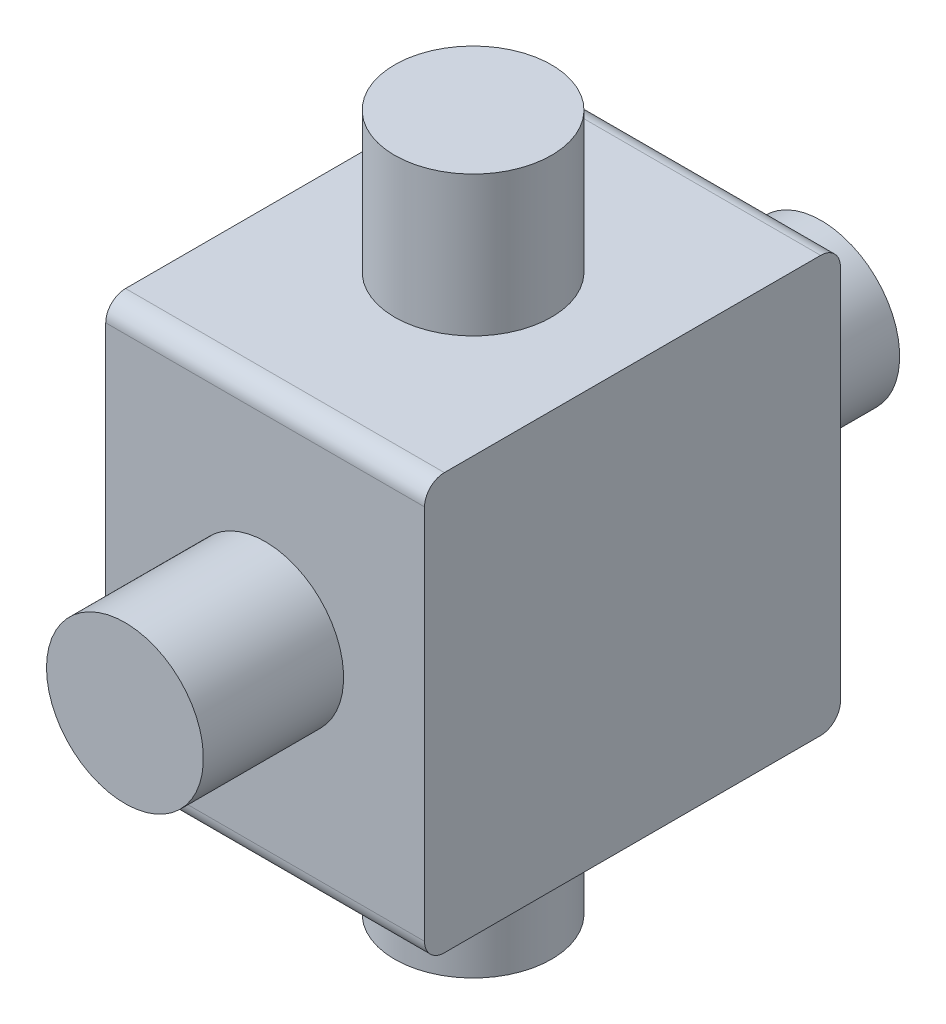
ISO-10303-21;
HEADER;
FILE_DESCRIPTION(('STEP AP214'),'2;1');
FILE_NAME('part.step','',(''),(''),'','','');
FILE_SCHEMA(('AUTOMOTIVE_DESIGN { 1 0 10303 214 1 1 1 1 }'));
ENDSEC;
DATA;
#1=APPLICATION_CONTEXT('core data for automotive mechanical design processes');
#2=APPLICATION_PROTOCOL_DEFINITION('international standard','automotive_design',2000,#1);
#3=PRODUCT_CONTEXT('',#1,'mechanical');
#4=PRODUCT('Part','Part','',(#3));
#5=PRODUCT_RELATED_PRODUCT_CATEGORY('part','',(#4));
#6=PRODUCT_DEFINITION_FORMATION('','',#4);
#7=PRODUCT_DEFINITION_CONTEXT('part definition',#1,'design');
#8=PRODUCT_DEFINITION('design','',#6,#7);
#9=PRODUCT_DEFINITION_SHAPE('','',#8);
#10=(LENGTH_UNIT() NAMED_UNIT(*) SI_UNIT(.MILLI.,.METRE.));
#11=(NAMED_UNIT(*) PLANE_ANGLE_UNIT() SI_UNIT($,.RADIAN.));
#12=(NAMED_UNIT(*) SI_UNIT($,.STERADIAN.) SOLID_ANGLE_UNIT());
#13=UNCERTAINTY_MEASURE_WITH_UNIT(LENGTH_MEASURE(1.E-05),#10,'distance_accuracy_value','');
#14=(GEOMETRIC_REPRESENTATION_CONTEXT(3) GLOBAL_UNCERTAINTY_ASSIGNED_CONTEXT((#13)) GLOBAL_UNIT_ASSIGNED_CONTEXT((#10,
#11,#12)) REPRESENTATION_CONTEXT('',''));
#15=CARTESIAN_POINT('',(0.,0.,0.));
#16=DIRECTION('',(0.,0.,1.));
#17=DIRECTION('',(1.,0.,0.));
#18=AXIS2_PLACEMENT_3D('',#15,#16,#17);
#19=CARTESIAN_POINT('',(-5.06,6.6,-6.6));
#20=DIRECTION('',(0.,1.,0.));
#21=DIRECTION('',(0.,0.,1.));
#22=AXIS2_PLACEMENT_3D('',#19,#20,#21);
#23=PLANE('',#22);
#24=CARTESIAN_POINT('',(0.,6.6,0.));
#25=DIRECTION('',(0.,1.,0.));
#26=DIRECTION('',(0.,0.,1.));
#27=AXIS2_PLACEMENT_3D('',#24,#25,#26);
#28=CIRCLE('',#27,2.49);
#29=CARTESIAN_POINT('',(0.,6.6,2.49));
#30=VERTEX_POINT('',#29);
#31=EDGE_CURVE('E130',#30,#30,#28,.T.);
#32=ORIENTED_EDGE('',*,*,#31,.F.);
#33=EDGE_LOOP('',(#32));
#34=FACE_BOUND('',#33,.T.);
#35=DIRECTION('',(0.,0.,1.));
#36=VECTOR('',#35,1.);
#37=CARTESIAN_POINT('',(-5.06,6.6,-6.6));
#38=LINE('',#37,#36);
#39=CARTESIAN_POINT('',(-5.06,6.6,-5.9714285714));
#40=VERTEX_POINT('',#39);
#41=CARTESIAN_POINT('',(-5.06,6.6,5.9714285714));
#42=VERTEX_POINT('',#41);
#43=EDGE_CURVE('E157',#40,#42,#38,.T.);
#44=ORIENTED_EDGE('',*,*,#43,.T.);
#45=DIRECTION('',(1.,0.,0.));
#46=VECTOR('',#45,1.);
#47=CARTESIAN_POINT('',(-5.06,6.6,5.9714285714));
#48=LINE('',#47,#46);
#49=CARTESIAN_POINT('',(5.06,6.6,5.9714285714));
#50=VERTEX_POINT('',#49);
#51=EDGE_CURVE('E11',#42,#50,#48,.T.);
#52=ORIENTED_EDGE('',*,*,#51,.T.);
#53=DIRECTION('',(0.,0.,1.));
#54=VECTOR('',#53,1.);
#55=CARTESIAN_POINT('',(5.06,6.6,-6.6));
#56=LINE('',#55,#54);
#57=CARTESIAN_POINT('',(5.06,6.6,-5.9714285714));
#58=VERTEX_POINT('',#57);
#59=EDGE_CURVE('E106',#58,#50,#56,.T.);
#60=ORIENTED_EDGE('',*,*,#59,.F.);
#61=DIRECTION('',(1.,0.,0.));
#62=VECTOR('',#61,1.);
#63=CARTESIAN_POINT('',(-5.06,6.6,-5.9714285714));
#64=LINE('',#63,#62);
#65=EDGE_CURVE('E42',#58,#40,#64,.F.);
#66=ORIENTED_EDGE('',*,*,#65,.T.);
#67=EDGE_LOOP('',(#44,#52,#60,#66));
#68=FACE_BOUND('',#67,.T.);
#69=ADVANCED_FACE('F34',(#34,#68),#23,.T.);
#70=CARTESIAN_POINT('',(-5.06,-6.6,-6.6));
#71=DIRECTION('',(0.,0.,-1.));
#72=DIRECTION('',(-1.,0.,0.));
#73=AXIS2_PLACEMENT_3D('',#70,#71,#72);
#74=PLANE('',#73);
#75=CARTESIAN_POINT('',(0.,0.,-6.6));
#76=DIRECTION('',(0.,0.,-1.));
#77=DIRECTION('',(-1.,0.,0.));
#78=AXIS2_PLACEMENT_3D('',#75,#76,#77);
#79=CIRCLE('',#78,2.49);
#80=CARTESIAN_POINT('',(-2.49,0.,-6.6));
#81=VERTEX_POINT('',#80);
#82=EDGE_CURVE('E126',#81,#81,#79,.T.);
#83=ORIENTED_EDGE('',*,*,#82,.F.);
#84=EDGE_LOOP('',(#83));
#85=FACE_BOUND('',#84,.T.);
#86=DIRECTION('',(0.,1.,0.));
#87=VECTOR('',#86,1.);
#88=CARTESIAN_POINT('',(5.06,-6.6,-6.6));
#89=LINE('',#88,#87);
#90=CARTESIAN_POINT('',(5.06,-5.9714285714,-6.6));
#91=VERTEX_POINT('',#90);
#92=CARTESIAN_POINT('',(5.06,5.9714285714,-6.6));
#93=VERTEX_POINT('',#92);
#94=EDGE_CURVE('E133',#91,#93,#89,.T.);
#95=ORIENTED_EDGE('',*,*,#94,.F.);
#96=DIRECTION('',(1.,0.,0.));
#97=VECTOR('',#96,1.);
#98=CARTESIAN_POINT('',(-5.06,-5.9714285714,-6.6));
#99=LINE('',#98,#97);
#100=CARTESIAN_POINT('',(-5.06,-5.9714285714,-6.6));
#101=VERTEX_POINT('',#100);
#102=EDGE_CURVE('E56',#91,#101,#99,.F.);
#103=ORIENTED_EDGE('',*,*,#102,.T.);
#104=DIRECTION('',(0.,1.,0.));
#105=VECTOR('',#104,1.);
#106=CARTESIAN_POINT('',(-5.06,-6.6,-6.6));
#107=LINE('',#106,#105);
#108=CARTESIAN_POINT('',(-5.06,5.9714285714,-6.6));
#109=VERTEX_POINT('',#108);
#110=EDGE_CURVE('E166',#101,#109,#107,.T.);
#111=ORIENTED_EDGE('',*,*,#110,.T.);
#112=DIRECTION('',(1.,0.,0.));
#113=VECTOR('',#112,1.);
#114=CARTESIAN_POINT('',(-5.06,5.9714285714,-6.6));
#115=LINE('',#114,#113);
#116=EDGE_CURVE('E151',#109,#93,#115,.T.);
#117=ORIENTED_EDGE('',*,*,#116,.T.);
#118=EDGE_LOOP('',(#95,#103,#111,#117));
#119=FACE_BOUND('',#118,.T.);
#120=ADVANCED_FACE('F165',(#85,#119),#74,.T.);
#121=CARTESIAN_POINT('',(-5.06,-6.6,6.6));
#122=DIRECTION('',(0.,-1.,0.));
#123=DIRECTION('',(0.,0.,-1.));
#124=AXIS2_PLACEMENT_3D('',#121,#122,#123);
#125=PLANE('',#124);
#126=CARTESIAN_POINT('',(0.,-6.6,0.));
#127=DIRECTION('',(0.,1.,0.));
#128=DIRECTION('',(0.,0.,1.));
#129=AXIS2_PLACEMENT_3D('',#126,#127,#128);
#130=CIRCLE('',#129,2.49);
#131=CARTESIAN_POINT('',(0.,-6.6,2.49));
#132=VERTEX_POINT('',#131);
#133=EDGE_CURVE('E187',#132,#132,#130,.T.);
#134=ORIENTED_EDGE('',*,*,#133,.T.);
#135=EDGE_LOOP('',(#134));
#136=FACE_BOUND('',#135,.T.);
#137=DIRECTION('',(0.,0.,-1.));
#138=VECTOR('',#137,1.);
#139=CARTESIAN_POINT('',(5.06,-6.6,6.6));
#140=LINE('',#139,#138);
#141=CARTESIAN_POINT('',(5.06,-6.6,5.9714285714));
#142=VERTEX_POINT('',#141);
#143=CARTESIAN_POINT('',(5.06,-6.6,-5.9714285714));
#144=VERTEX_POINT('',#143);
#145=EDGE_CURVE('E121',#142,#144,#140,.T.);
#146=ORIENTED_EDGE('',*,*,#145,.F.);
#147=DIRECTION('',(1.,0.,0.));
#148=VECTOR('',#147,1.);
#149=CARTESIAN_POINT('',(-5.06,-6.6,5.9714285714));
#150=LINE('',#149,#148);
#151=CARTESIAN_POINT('',(-5.06,-6.6,5.9714285714));
#152=VERTEX_POINT('',#151);
#153=EDGE_CURVE('E143',#142,#152,#150,.F.);
#154=ORIENTED_EDGE('',*,*,#153,.T.);
#155=DIRECTION('',(0.,0.,-1.));
#156=VECTOR('',#155,1.);
#157=CARTESIAN_POINT('',(-5.06,-6.6,6.6));
#158=LINE('',#157,#156);
#159=CARTESIAN_POINT('',(-5.06,-6.6,-5.9714285714));
#160=VERTEX_POINT('',#159);
#161=EDGE_CURVE('E173',#152,#160,#158,.T.);
#162=ORIENTED_EDGE('',*,*,#161,.T.);
#163=DIRECTION('',(1.,0.,0.));
#164=VECTOR('',#163,1.);
#165=CARTESIAN_POINT('',(-5.06,-6.6,-5.9714285714));
#166=LINE('',#165,#164);
#167=EDGE_CURVE('E140',#160,#144,#166,.T.);
#168=ORIENTED_EDGE('',*,*,#167,.T.);
#169=EDGE_LOOP('',(#146,#154,#162,#168));
#170=FACE_BOUND('',#169,.T.);
#171=ADVANCED_FACE('F220',(#136,#170),#125,.T.);
#172=CARTESIAN_POINT('',(-5.06,6.6,6.6));
#173=DIRECTION('',(0.,0.,1.));
#174=DIRECTION('',(1.,0.,0.));
#175=AXIS2_PLACEMENT_3D('',#172,#173,#174);
#176=PLANE('',#175);
#177=CARTESIAN_POINT('',(0.,0.,6.6));
#178=DIRECTION('',(0.,0.,-1.));
#179=DIRECTION('',(-1.,0.,0.));
#180=AXIS2_PLACEMENT_3D('',#177,#178,#179);
#181=CIRCLE('',#180,2.49);
#182=CARTESIAN_POINT('',(-2.49,0.,6.6));
#183=VERTEX_POINT('',#182);
#184=EDGE_CURVE('E193',#183,#183,#181,.T.);
#185=ORIENTED_EDGE('',*,*,#184,.T.);
#186=EDGE_LOOP('',(#185));
#187=FACE_BOUND('',#186,.T.);
#188=DIRECTION('',(0.,-1.,0.));
#189=VECTOR('',#188,1.);
#190=CARTESIAN_POINT('',(-5.06,6.6,6.6));
#191=LINE('',#190,#189);
#192=CARTESIAN_POINT('',(-5.06,5.9714285714,6.6));
#193=VERTEX_POINT('',#192);
#194=CARTESIAN_POINT('',(-5.06,-5.9714285714,6.6));
#195=VERTEX_POINT('',#194);
#196=EDGE_CURVE('E161',#193,#195,#191,.T.);
#197=ORIENTED_EDGE('',*,*,#196,.T.);
#198=DIRECTION('',(1.,0.,0.));
#199=VECTOR('',#198,1.);
#200=CARTESIAN_POINT('',(-5.06,-5.9714285714,6.6));
#201=LINE('',#200,#199);
#202=CARTESIAN_POINT('',(5.06,-5.9714285714,6.6));
#203=VERTEX_POINT('',#202);
#204=EDGE_CURVE('E120',#195,#203,#201,.T.);
#205=ORIENTED_EDGE('',*,*,#204,.T.);
#206=DIRECTION('',(0.,-1.,0.));
#207=VECTOR('',#206,1.);
#208=CARTESIAN_POINT('',(5.06,6.6,6.6));
#209=LINE('',#208,#207);
#210=CARTESIAN_POINT('',(5.06,5.9714285714,6.6));
#211=VERTEX_POINT('',#210);
#212=EDGE_CURVE('E104',#211,#203,#209,.T.);
#213=ORIENTED_EDGE('',*,*,#212,.F.);
#214=DIRECTION('',(1.,0.,0.));
#215=VECTOR('',#214,1.);
#216=CARTESIAN_POINT('',(-5.06,5.9714285714,6.6));
#217=LINE('',#216,#215);
#218=EDGE_CURVE('E117',#211,#193,#217,.F.);
#219=ORIENTED_EDGE('',*,*,#218,.T.);
#220=EDGE_LOOP('',(#197,#205,#213,#219));
#221=FACE_BOUND('',#220,.T.);
#222=ADVANCED_FACE('F116',(#187,#221),#176,.T.);
#223=CARTESIAN_POINT('',(-5.06,0.,0.));
#224=DIRECTION('',(1.,0.,0.));
#225=DIRECTION('',(0.,0.,-1.));
#226=AXIS2_PLACEMENT_3D('',#223,#224,#225);
#227=PLANE('',#226);
#228=ORIENTED_EDGE('',*,*,#161,.F.);
#229=CARTESIAN_POINT('',(-5.06,-5.9714285714,5.9714285714));
#230=DIRECTION('',(1.,0.,0.));
#231=DIRECTION('',(0.,0.,-1.));
#232=AXIS2_PLACEMENT_3D('',#229,#230,#231);
#233=CIRCLE('',#232,0.6285714286);
#234=EDGE_CURVE('E149',#152,#195,#233,.F.);
#235=ORIENTED_EDGE('',*,*,#234,.T.);
#236=ORIENTED_EDGE('',*,*,#196,.F.);
#237=CARTESIAN_POINT('',(-5.06,5.9714285714,5.9714285714));
#238=DIRECTION('',(1.,0.,0.));
#239=DIRECTION('',(0.,0.,-1.));
#240=AXIS2_PLACEMENT_3D('',#237,#238,#239);
#241=CIRCLE('',#240,0.6285714286);
#242=EDGE_CURVE('E125',#193,#42,#241,.F.);
#243=ORIENTED_EDGE('',*,*,#242,.T.);
#244=ORIENTED_EDGE('',*,*,#43,.F.);
#245=CARTESIAN_POINT('',(-5.06,5.9714285714,-5.9714285714));
#246=DIRECTION('',(1.,0.,0.));
#247=DIRECTION('',(0.,0.,-1.));
#248=AXIS2_PLACEMENT_3D('',#245,#246,#247);
#249=CIRCLE('',#248,0.6285714286);
#250=EDGE_CURVE('E49',#40,#109,#249,.F.);
#251=ORIENTED_EDGE('',*,*,#250,.T.);
#252=ORIENTED_EDGE('',*,*,#110,.F.);
#253=CARTESIAN_POINT('',(-5.06,-5.9714285714,-5.9714285714));
#254=DIRECTION('',(1.,0.,0.));
#255=DIRECTION('',(0.,0.,-1.));
#256=AXIS2_PLACEMENT_3D('',#253,#254,#255);
#257=CIRCLE('',#256,0.6285714286);
#258=EDGE_CURVE('E147',#101,#160,#257,.F.);
#259=ORIENTED_EDGE('',*,*,#258,.T.);
#260=EDGE_LOOP('',(#228,#235,#236,#243,#244,#251,#252,#259));
#261=FACE_BOUND('',#260,.T.);
#262=ADVANCED_FACE('F160',(#261),#227,.F.);
#263=CARTESIAN_POINT('',(5.06,0.,0.));
#264=DIRECTION('',(1.,0.,0.));
#265=DIRECTION('',(0.,0.,-1.));
#266=AXIS2_PLACEMENT_3D('',#263,#264,#265);
#267=PLANE('',#266);
#268=ORIENTED_EDGE('',*,*,#212,.T.);
#269=CARTESIAN_POINT('',(5.06,-5.9714285714,5.9714285714));
#270=DIRECTION('',(1.,0.,0.));
#271=DIRECTION('',(0.,0.,-1.));
#272=AXIS2_PLACEMENT_3D('',#269,#270,#271);
#273=CIRCLE('',#272,0.6285714286);
#274=EDGE_CURVE('E138',#203,#142,#273,.T.);
#275=ORIENTED_EDGE('',*,*,#274,.T.);
#276=ORIENTED_EDGE('',*,*,#145,.T.);
#277=CARTESIAN_POINT('',(5.06,-5.9714285714,-5.9714285714));
#278=DIRECTION('',(1.,0.,0.));
#279=DIRECTION('',(0.,0.,-1.));
#280=AXIS2_PLACEMENT_3D('',#277,#278,#279);
#281=CIRCLE('',#280,0.6285714286);
#282=EDGE_CURVE('E110',#144,#91,#281,.T.);
#283=ORIENTED_EDGE('',*,*,#282,.T.);
#284=ORIENTED_EDGE('',*,*,#94,.T.);
#285=CARTESIAN_POINT('',(5.06,5.9714285714,-5.9714285714));
#286=DIRECTION('',(1.,0.,0.));
#287=DIRECTION('',(0.,0.,-1.));
#288=AXIS2_PLACEMENT_3D('',#285,#286,#287);
#289=CIRCLE('',#288,0.6285714286);
#290=EDGE_CURVE('E111',#93,#58,#289,.T.);
#291=ORIENTED_EDGE('',*,*,#290,.T.);
#292=ORIENTED_EDGE('',*,*,#59,.T.);
#293=CARTESIAN_POINT('',(5.06,5.9714285714,5.9714285714));
#294=DIRECTION('',(1.,0.,0.));
#295=DIRECTION('',(0.,0.,-1.));
#296=AXIS2_PLACEMENT_3D('',#293,#294,#295);
#297=CIRCLE('',#296,0.6285714286);
#298=EDGE_CURVE('E101',#50,#211,#297,.T.);
#299=ORIENTED_EDGE('',*,*,#298,.T.);
#300=EDGE_LOOP('',(#268,#275,#276,#283,#284,#291,#292,#299));
#301=FACE_BOUND('',#300,.T.);
#302=ADVANCED_FACE('F103',(#301),#267,.T.);
#303=CARTESIAN_POINT('',(0.,6.6,0.));
#304=DIRECTION('',(0.,1.,0.));
#305=DIRECTION('',(0.,0.,1.));
#306=AXIS2_PLACEMENT_3D('',#303,#304,#305);
#307=CYLINDRICAL_SURFACE('',#306,2.49);
#308=ORIENTED_EDGE('',*,*,#31,.T.);
#309=EDGE_LOOP('',(#308));
#310=FACE_BOUND('',#309,.T.);
#311=CARTESIAN_POINT('',(0.,11.05,0.));
#312=DIRECTION('',(0.,1.,0.));
#313=DIRECTION('',(0.,0.,1.));
#314=AXIS2_PLACEMENT_3D('',#311,#312,#313);
#315=CIRCLE('',#314,2.49);
#316=CARTESIAN_POINT('',(0.,11.05,2.49));
#317=VERTEX_POINT('',#316);
#318=EDGE_CURVE('E171',#317,#317,#315,.T.);
#319=ORIENTED_EDGE('',*,*,#318,.F.);
#320=EDGE_LOOP('',(#319));
#321=FACE_BOUND('',#320,.T.);
#322=ADVANCED_FACE('F265',(#310,#321),#307,.T.);
#323=CARTESIAN_POINT('',(0.,11.05,0.));
#324=DIRECTION('',(0.,1.,0.));
#325=DIRECTION('',(0.,0.,1.));
#326=AXIS2_PLACEMENT_3D('',#323,#324,#325);
#327=PLANE('',#326);
#328=ORIENTED_EDGE('',*,*,#318,.T.);
#329=EDGE_LOOP('',(#328));
#330=FACE_BOUND('',#329,.T.);
#331=ADVANCED_FACE('F344',(#330),#327,.T.);
#332=CARTESIAN_POINT('',(0.,0.,-6.6));
#333=DIRECTION('',(0.,0.,-1.));
#334=DIRECTION('',(-1.,0.,0.));
#335=AXIS2_PLACEMENT_3D('',#332,#333,#334);
#336=CYLINDRICAL_SURFACE('',#335,2.49);
#337=ORIENTED_EDGE('',*,*,#82,.T.);
#338=EDGE_LOOP('',(#337));
#339=FACE_BOUND('',#338,.T.);
#340=CARTESIAN_POINT('',(0.,0.,-11.05));
#341=DIRECTION('',(0.,0.,-1.));
#342=DIRECTION('',(-1.,0.,0.));
#343=AXIS2_PLACEMENT_3D('',#340,#341,#342);
#344=CIRCLE('',#343,2.49);
#345=CARTESIAN_POINT('',(-2.49,0.,-11.05));
#346=VERTEX_POINT('',#345);
#347=EDGE_CURVE('E180',#346,#346,#344,.T.);
#348=ORIENTED_EDGE('',*,*,#347,.F.);
#349=EDGE_LOOP('',(#348));
#350=FACE_BOUND('',#349,.T.);
#351=ADVANCED_FACE('F334',(#339,#350),#336,.T.);
#352=CARTESIAN_POINT('',(0.,0.,-11.05));
#353=DIRECTION('',(0.,0.,-1.));
#354=DIRECTION('',(-1.,0.,0.));
#355=AXIS2_PLACEMENT_3D('',#352,#353,#354);
#356=PLANE('',#355);
#357=ORIENTED_EDGE('',*,*,#347,.T.);
#358=EDGE_LOOP('',(#357));
#359=FACE_BOUND('',#358,.T.);
#360=ADVANCED_FACE('F324',(#359),#356,.T.);
#361=CARTESIAN_POINT('',(0.,-11.05,0.));
#362=DIRECTION('',(0.,1.,0.));
#363=DIRECTION('',(0.,0.,1.));
#364=AXIS2_PLACEMENT_3D('',#361,#362,#363);
#365=CYLINDRICAL_SURFACE('',#364,2.49);
#366=CARTESIAN_POINT('',(0.,-11.05,0.));
#367=DIRECTION('',(0.,1.,0.));
#368=DIRECTION('',(0.,0.,1.));
#369=AXIS2_PLACEMENT_3D('',#366,#367,#368);
#370=CIRCLE('',#369,2.49);
#371=CARTESIAN_POINT('',(0.,-11.05,2.49));
#372=VERTEX_POINT('',#371);
#373=EDGE_CURVE('E184',#372,#372,#370,.T.);
#374=ORIENTED_EDGE('',*,*,#373,.T.);
#375=EDGE_LOOP('',(#374));
#376=FACE_BOUND('',#375,.T.);
#377=ORIENTED_EDGE('',*,*,#133,.F.);
#378=EDGE_LOOP('',(#377));
#379=FACE_BOUND('',#378,.T.);
#380=ADVANCED_FACE('F211',(#376,#379),#365,.T.);
#381=CARTESIAN_POINT('',(2.49,-11.05,0.));
#382=DIRECTION('',(0.,-1.,0.));
#383=DIRECTION('',(0.,0.,-1.));
#384=AXIS2_PLACEMENT_3D('',#381,#382,#383);
#385=PLANE('',#384);
#386=ORIENTED_EDGE('',*,*,#373,.F.);
#387=EDGE_LOOP('',(#386));
#388=FACE_BOUND('',#387,.T.);
#389=ADVANCED_FACE('F201',(#388),#385,.T.);
#390=CARTESIAN_POINT('',(0.,0.,11.05));
#391=DIRECTION('',(0.,0.,-1.));
#392=DIRECTION('',(-1.,0.,0.));
#393=AXIS2_PLACEMENT_3D('',#390,#391,#392);
#394=CYLINDRICAL_SURFACE('',#393,2.49);
#395=CARTESIAN_POINT('',(0.,0.,11.05));
#396=DIRECTION('',(0.,0.,-1.));
#397=DIRECTION('',(-1.,0.,0.));
#398=AXIS2_PLACEMENT_3D('',#395,#396,#397);
#399=CIRCLE('',#398,2.49);
#400=CARTESIAN_POINT('',(-2.49,0.,11.05));
#401=VERTEX_POINT('',#400);
#402=EDGE_CURVE('E190',#401,#401,#399,.T.);
#403=ORIENTED_EDGE('',*,*,#402,.T.);
#404=EDGE_LOOP('',(#403));
#405=FACE_BOUND('',#404,.T.);
#406=ORIENTED_EDGE('',*,*,#184,.F.);
#407=EDGE_LOOP('',(#406));
#408=FACE_BOUND('',#407,.T.);
#409=ADVANCED_FACE('F198',(#405,#408),#394,.T.);
#410=CARTESIAN_POINT('',(2.49,0.,11.05));
#411=DIRECTION('',(0.,0.,1.));
#412=DIRECTION('',(1.,0.,0.));
#413=AXIS2_PLACEMENT_3D('',#410,#411,#412);
#414=PLANE('',#413);
#415=ORIENTED_EDGE('',*,*,#402,.F.);
#416=EDGE_LOOP('',(#415));
#417=FACE_BOUND('',#416,.T.);
#418=ADVANCED_FACE('F200',(#417),#414,.T.);
#419=CARTESIAN_POINT('',(-5.06,-5.9714285714,5.9714285714));
#420=DIRECTION('',(1.,0.,0.));
#421=DIRECTION('',(0.,0.,-1.));
#422=AXIS2_PLACEMENT_3D('',#419,#420,#421);
#423=CYLINDRICAL_SURFACE('',#422,0.6285714286);
#424=ORIENTED_EDGE('',*,*,#234,.F.);
#425=ORIENTED_EDGE('',*,*,#153,.F.);
#426=ORIENTED_EDGE('',*,*,#274,.F.);
#427=ORIENTED_EDGE('',*,*,#204,.F.);
#428=EDGE_LOOP('',(#424,#425,#426,#427));
#429=FACE_BOUND('',#428,.T.);
#430=ADVANCED_FACE('F208',(#429),#423,.T.);
#431=CARTESIAN_POINT('',(-5.06,-5.9714285714,-5.9714285714));
#432=DIRECTION('',(1.,0.,0.));
#433=DIRECTION('',(0.,0.,-1.));
#434=AXIS2_PLACEMENT_3D('',#431,#432,#433);
#435=CYLINDRICAL_SURFACE('',#434,0.6285714286);
#436=ORIENTED_EDGE('',*,*,#258,.F.);
#437=ORIENTED_EDGE('',*,*,#102,.F.);
#438=ORIENTED_EDGE('',*,*,#282,.F.);
#439=ORIENTED_EDGE('',*,*,#167,.F.);
#440=EDGE_LOOP('',(#436,#437,#438,#439));
#441=FACE_BOUND('',#440,.T.);
#442=ADVANCED_FACE('F229',(#441),#435,.T.);
#443=CARTESIAN_POINT('',(-5.06,5.9714285714,5.9714285714));
#444=DIRECTION('',(1.,0.,0.));
#445=DIRECTION('',(0.,0.,-1.));
#446=AXIS2_PLACEMENT_3D('',#443,#444,#445);
#447=CYLINDRICAL_SURFACE('',#446,0.6285714286);
#448=ORIENTED_EDGE('',*,*,#242,.F.);
#449=ORIENTED_EDGE('',*,*,#218,.F.);
#450=ORIENTED_EDGE('',*,*,#298,.F.);
#451=ORIENTED_EDGE('',*,*,#51,.F.);
#452=EDGE_LOOP('',(#448,#449,#450,#451));
#453=FACE_BOUND('',#452,.T.);
#454=ADVANCED_FACE('F124',(#453),#447,.T.);
#455=CARTESIAN_POINT('',(-5.06,5.9714285714,-5.9714285714));
#456=DIRECTION('',(1.,0.,0.));
#457=DIRECTION('',(0.,0.,-1.));
#458=AXIS2_PLACEMENT_3D('',#455,#456,#457);
#459=CYLINDRICAL_SURFACE('',#458,0.6285714286);
#460=ORIENTED_EDGE('',*,*,#250,.F.);
#461=ORIENTED_EDGE('',*,*,#65,.F.);
#462=ORIENTED_EDGE('',*,*,#290,.F.);
#463=ORIENTED_EDGE('',*,*,#116,.F.);
#464=EDGE_LOOP('',(#460,#461,#462,#463));
#465=FACE_BOUND('',#464,.T.);
#466=ADVANCED_FACE('F36',(#465),#459,.T.);
#467=CLOSED_SHELL('',(#69,#120,#171,#222,#262,#302,#322,#331,#351,#360,#380,#389,#409,#418,#430,
#442,#454,#466));
#468=MANIFOLD_SOLID_BREP('B2',#467);
#469=ADVANCED_BREP_SHAPE_REPRESENTATION('',(#18,#468),#14);
#470=SHAPE_DEFINITION_REPRESENTATION(#9,#469);
ENDSEC;
END-ISO-10303-21;
